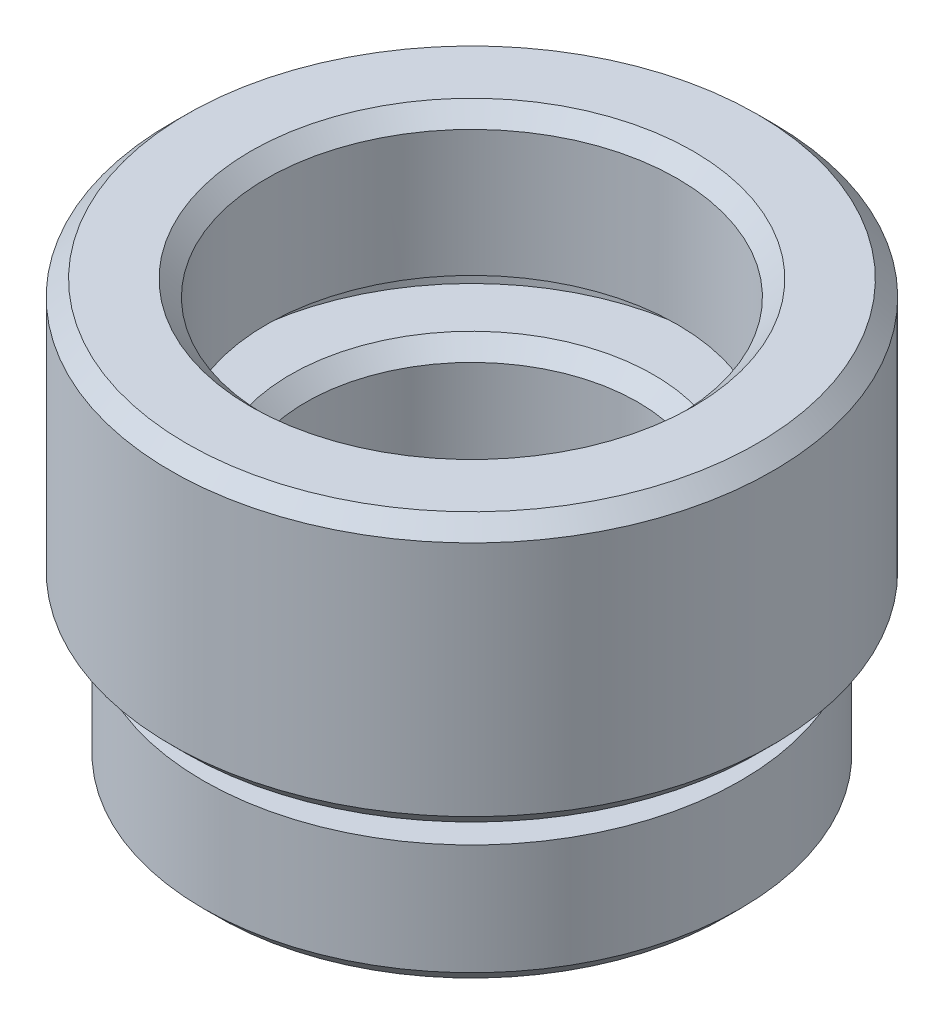
ISO-10303-21;
HEADER;
FILE_DESCRIPTION(('STEP AP214'),'2;1');
FILE_NAME('part.step','',(''),(''),'','','');
FILE_SCHEMA(('AUTOMOTIVE_DESIGN { 1 0 10303 214 1 1 1 1 }'));
ENDSEC;
DATA;
#1=APPLICATION_CONTEXT('core data for automotive mechanical design processes');
#2=APPLICATION_PROTOCOL_DEFINITION('international standard','automotive_design',2000,#1);
#3=PRODUCT_CONTEXT('',#1,'mechanical');
#4=PRODUCT('Part','Part','',(#3));
#5=PRODUCT_RELATED_PRODUCT_CATEGORY('part','',(#4));
#6=PRODUCT_DEFINITION_FORMATION('','',#4);
#7=PRODUCT_DEFINITION_CONTEXT('part definition',#1,'design');
#8=PRODUCT_DEFINITION('design','',#6,#7);
#9=PRODUCT_DEFINITION_SHAPE('','',#8);
#10=(LENGTH_UNIT() NAMED_UNIT(*) SI_UNIT(.MILLI.,.METRE.));
#11=(NAMED_UNIT(*) PLANE_ANGLE_UNIT() SI_UNIT($,.RADIAN.));
#12=(NAMED_UNIT(*) SI_UNIT($,.STERADIAN.) SOLID_ANGLE_UNIT());
#13=UNCERTAINTY_MEASURE_WITH_UNIT(LENGTH_MEASURE(1.E-05),#10,'distance_accuracy_value','');
#14=(GEOMETRIC_REPRESENTATION_CONTEXT(3) GLOBAL_UNCERTAINTY_ASSIGNED_CONTEXT((#13)) GLOBAL_UNIT_ASSIGNED_CONTEXT((#10,
#11,#12)) REPRESENTATION_CONTEXT('',''));
#15=CARTESIAN_POINT('',(0.,0.,0.));
#16=DIRECTION('',(0.,0.,1.));
#17=DIRECTION('',(1.,0.,0.));
#18=AXIS2_PLACEMENT_3D('',#15,#16,#17);
#19=CARTESIAN_POINT('',(6.5,13.5,0.));
#20=DIRECTION('',(0.,1.,0.));
#21=DIRECTION('',(0.,0.,1.));
#22=AXIS2_PLACEMENT_3D('',#19,#20,#21);
#23=PLANE('',#22);
#24=CARTESIAN_POINT('',(0.,13.5,0.));
#25=DIRECTION('',(0.,1.,0.));
#26=DIRECTION('',(0.,0.,1.));
#27=AXIS2_PLACEMENT_3D('',#24,#25,#26);
#28=CIRCLE('',#27,7.);
#29=CARTESIAN_POINT('',(0.,13.5,7.));
#30=VERTEX_POINT('',#29);
#31=EDGE_CURVE('E40',#30,#30,#28,.F.);
#32=ORIENTED_EDGE('',*,*,#31,.T.);
#33=EDGE_LOOP('',(#32));
#34=FACE_BOUND('',#33,.T.);
#35=CARTESIAN_POINT('',(0.,13.5,0.));
#36=DIRECTION('',(0.,-1.,0.));
#37=DIRECTION('',(0.,0.,-1.));
#38=AXIS2_PLACEMENT_3D('',#35,#36,#37);
#39=CIRCLE('',#38,9.025);
#40=CARTESIAN_POINT('',(0.,13.5,-9.025));
#41=VERTEX_POINT('',#40);
#42=EDGE_CURVE('E107',#41,#41,#39,.T.);
#43=ORIENTED_EDGE('',*,*,#42,.F.);
#44=EDGE_LOOP('',(#43));
#45=FACE_BOUND('',#44,.T.);
#46=ADVANCED_FACE('F33',(#34,#45),#23,.T.);
#47=CARTESIAN_POINT('',(0.,0.,0.));
#48=DIRECTION('',(0.,-1.,0.));
#49=DIRECTION('',(0.,0.,-1.));
#50=AXIS2_PLACEMENT_3D('',#47,#48,#49);
#51=CYLINDRICAL_SURFACE('',#50,6.5);
#52=CARTESIAN_POINT('',(0.,13.,0.));
#53=DIRECTION('',(0.,1.,0.));
#54=DIRECTION('',(0.,0.,1.));
#55=AXIS2_PLACEMENT_3D('',#52,#53,#54);
#56=CIRCLE('',#55,6.5);
#57=CARTESIAN_POINT('',(0.,13.,6.5));
#58=VERTEX_POINT('',#57);
#59=EDGE_CURVE('E10',#58,#58,#56,.T.);
#60=ORIENTED_EDGE('',*,*,#59,.T.);
#61=EDGE_LOOP('',(#60));
#62=FACE_BOUND('',#61,.T.);
#63=CARTESIAN_POINT('',(0.,9.,0.));
#64=DIRECTION('',(0.,-1.,0.));
#65=DIRECTION('',(0.,0.,-1.));
#66=AXIS2_PLACEMENT_3D('',#63,#64,#65);
#67=CIRCLE('',#66,6.5);
#68=CARTESIAN_POINT('',(0.,9.,-6.5));
#69=VERTEX_POINT('',#68);
#70=EDGE_CURVE('E53',#69,#69,#67,.T.);
#71=ORIENTED_EDGE('',*,*,#70,.T.);
#72=EDGE_LOOP('',(#71));
#73=FACE_BOUND('',#72,.T.);
#74=ADVANCED_FACE('F115',(#62,#73),#51,.F.);
#75=CARTESIAN_POINT('',(7.6,9.,0.));
#76=DIRECTION('',(0.,-1.,0.));
#77=DIRECTION('',(0.,0.,-1.));
#78=AXIS2_PLACEMENT_3D('',#75,#76,#77);
#79=PLANE('',#78);
#80=CARTESIAN_POINT('',(0.,9.,0.));
#81=DIRECTION('',(0.,-1.,0.));
#82=DIRECTION('',(0.,0.,-1.));
#83=AXIS2_PLACEMENT_3D('',#80,#81,#82);
#84=CIRCLE('',#83,7.6);
#85=CARTESIAN_POINT('',(0.,9.,-7.6));
#86=VERTEX_POINT('',#85);
#87=EDGE_CURVE('E56',#86,#86,#84,.T.);
#88=ORIENTED_EDGE('',*,*,#87,.T.);
#89=EDGE_LOOP('',(#88));
#90=FACE_BOUND('',#89,.T.);
#91=ORIENTED_EDGE('',*,*,#70,.F.);
#92=EDGE_LOOP('',(#91));
#93=FACE_BOUND('',#92,.T.);
#94=ADVANCED_FACE('F120',(#90,#93),#79,.T.);
#95=CARTESIAN_POINT('',(0.,0.,0.));
#96=DIRECTION('',(0.,-1.,0.));
#97=DIRECTION('',(0.,0.,-1.));
#98=AXIS2_PLACEMENT_3D('',#95,#96,#97);
#99=CYLINDRICAL_SURFACE('',#98,7.6);
#100=CARTESIAN_POINT('',(0.,8.,0.));
#101=DIRECTION('',(0.,-1.,0.));
#102=DIRECTION('',(0.,0.,-1.));
#103=AXIS2_PLACEMENT_3D('',#100,#101,#102);
#104=CIRCLE('',#103,7.6);
#105=CARTESIAN_POINT('',(0.,8.,-7.6));
#106=VERTEX_POINT('',#105);
#107=EDGE_CURVE('E59',#106,#106,#104,.T.);
#108=ORIENTED_EDGE('',*,*,#107,.T.);
#109=EDGE_LOOP('',(#108));
#110=FACE_BOUND('',#109,.T.);
#111=ORIENTED_EDGE('',*,*,#87,.F.);
#112=EDGE_LOOP('',(#111));
#113=FACE_BOUND('',#112,.T.);
#114=ADVANCED_FACE('F141',(#110,#113),#99,.F.);
#115=CARTESIAN_POINT('',(5.25,8.,0.));
#116=DIRECTION('',(0.,1.,0.));
#117=DIRECTION('',(0.,0.,1.));
#118=AXIS2_PLACEMENT_3D('',#115,#116,#117);
#119=PLANE('',#118);
#120=CARTESIAN_POINT('',(0.,8.,0.));
#121=DIRECTION('',(0.,1.,0.));
#122=DIRECTION('',(0.,0.,1.));
#123=AXIS2_PLACEMENT_3D('',#120,#121,#122);
#124=CIRCLE('',#123,5.75);
#125=CARTESIAN_POINT('',(0.,8.,5.75));
#126=VERTEX_POINT('',#125);
#127=EDGE_CURVE('E48',#126,#126,#124,.F.);
#128=ORIENTED_EDGE('',*,*,#127,.T.);
#129=EDGE_LOOP('',(#128));
#130=FACE_BOUND('',#129,.T.);
#131=ORIENTED_EDGE('',*,*,#107,.F.);
#132=EDGE_LOOP('',(#131));
#133=FACE_BOUND('',#132,.T.);
#134=ADVANCED_FACE('F137',(#130,#133),#119,.T.);
#135=CARTESIAN_POINT('',(0.,0.,0.));
#136=DIRECTION('',(0.,-1.,0.));
#137=DIRECTION('',(0.,0.,-1.));
#138=AXIS2_PLACEMENT_3D('',#135,#136,#137);
#139=CYLINDRICAL_SURFACE('',#138,5.25);
#140=CARTESIAN_POINT('',(0.,7.5,0.));
#141=DIRECTION('',(0.,1.,0.));
#142=DIRECTION('',(0.,0.,1.));
#143=AXIS2_PLACEMENT_3D('',#140,#141,#142);
#144=CIRCLE('',#143,5.25);
#145=CARTESIAN_POINT('',(0.,7.5,5.25));
#146=VERTEX_POINT('',#145);
#147=EDGE_CURVE('E44',#146,#146,#144,.T.);
#148=ORIENTED_EDGE('',*,*,#147,.T.);
#149=EDGE_LOOP('',(#148));
#150=FACE_BOUND('',#149,.T.);
#151=CARTESIAN_POINT('',(0.,4.5,0.));
#152=DIRECTION('',(0.,-1.,0.));
#153=DIRECTION('',(0.,0.,-1.));
#154=AXIS2_PLACEMENT_3D('',#151,#152,#153);
#155=CIRCLE('',#154,5.25);
#156=CARTESIAN_POINT('',(0.,4.5,-5.25));
#157=VERTEX_POINT('',#156);
#158=EDGE_CURVE('E62',#157,#157,#155,.T.);
#159=ORIENTED_EDGE('',*,*,#158,.T.);
#160=EDGE_LOOP('',(#159));
#161=FACE_BOUND('',#160,.T.);
#162=ADVANCED_FACE('F140',(#150,#161),#139,.F.);
#163=CARTESIAN_POINT('',(6.35,4.5,0.));
#164=DIRECTION('',(0.,-1.,0.));
#165=DIRECTION('',(0.,0.,-1.));
#166=AXIS2_PLACEMENT_3D('',#163,#164,#165);
#167=PLANE('',#166);
#168=CARTESIAN_POINT('',(0.,4.5,0.));
#169=DIRECTION('',(0.,-1.,0.));
#170=DIRECTION('',(0.,0.,-1.));
#171=AXIS2_PLACEMENT_3D('',#168,#169,#170);
#172=CIRCLE('',#171,6.35);
#173=CARTESIAN_POINT('',(0.,4.5,-6.35));
#174=VERTEX_POINT('',#173);
#175=EDGE_CURVE('E65',#174,#174,#172,.T.);
#176=ORIENTED_EDGE('',*,*,#175,.T.);
#177=EDGE_LOOP('',(#176));
#178=FACE_BOUND('',#177,.T.);
#179=ORIENTED_EDGE('',*,*,#158,.F.);
#180=EDGE_LOOP('',(#179));
#181=FACE_BOUND('',#180,.T.);
#182=ADVANCED_FACE('F159',(#178,#181),#167,.T.);
#183=CARTESIAN_POINT('',(0.,0.,0.));
#184=DIRECTION('',(0.,-1.,0.));
#185=DIRECTION('',(0.,0.,-1.));
#186=AXIS2_PLACEMENT_3D('',#183,#184,#185);
#187=CYLINDRICAL_SURFACE('',#186,6.35);
#188=CARTESIAN_POINT('',(0.,3.5,0.));
#189=DIRECTION('',(0.,-1.,0.));
#190=DIRECTION('',(0.,0.,-1.));
#191=AXIS2_PLACEMENT_3D('',#188,#189,#190);
#192=CIRCLE('',#191,6.35);
#193=CARTESIAN_POINT('',(0.,3.5,-6.35));
#194=VERTEX_POINT('',#193);
#195=EDGE_CURVE('E68',#194,#194,#192,.T.);
#196=ORIENTED_EDGE('',*,*,#195,.T.);
#197=EDGE_LOOP('',(#196));
#198=FACE_BOUND('',#197,.T.);
#199=ORIENTED_EDGE('',*,*,#175,.F.);
#200=EDGE_LOOP('',(#199));
#201=FACE_BOUND('',#200,.T.);
#202=ADVANCED_FACE('F163',(#198,#201),#187,.F.);
#203=CARTESIAN_POINT('',(5.,3.5,0.));
#204=DIRECTION('',(0.,1.,0.));
#205=DIRECTION('',(0.,0.,1.));
#206=AXIS2_PLACEMENT_3D('',#203,#204,#205);
#207=PLANE('',#206);
#208=CARTESIAN_POINT('',(0.,3.5,0.));
#209=DIRECTION('',(0.,-1.,0.));
#210=DIRECTION('',(0.,0.,-1.));
#211=AXIS2_PLACEMENT_3D('',#208,#209,#210);
#212=CIRCLE('',#211,5.);
#213=CARTESIAN_POINT('',(0.,3.5,-5.));
#214=VERTEX_POINT('',#213);
#215=EDGE_CURVE('E71',#214,#214,#212,.T.);
#216=ORIENTED_EDGE('',*,*,#215,.T.);
#217=EDGE_LOOP('',(#216));
#218=FACE_BOUND('',#217,.T.);
#219=ORIENTED_EDGE('',*,*,#195,.F.);
#220=EDGE_LOOP('',(#219));
#221=FACE_BOUND('',#220,.T.);
#222=ADVANCED_FACE('F167',(#218,#221),#207,.T.);
#223=CARTESIAN_POINT('',(0.,0.,0.));
#224=DIRECTION('',(0.,-1.,0.));
#225=DIRECTION('',(0.,0.,-1.));
#226=AXIS2_PLACEMENT_3D('',#223,#224,#225);
#227=CYLINDRICAL_SURFACE('',#226,5.);
#228=CARTESIAN_POINT('',(0.,2.,0.));
#229=DIRECTION('',(0.,-1.,0.));
#230=DIRECTION('',(0.,0.,-1.));
#231=AXIS2_PLACEMENT_3D('',#228,#229,#230);
#232=CIRCLE('',#231,5.);
#233=CARTESIAN_POINT('',(0.,2.,-5.));
#234=VERTEX_POINT('',#233);
#235=EDGE_CURVE('E74',#234,#234,#232,.T.);
#236=ORIENTED_EDGE('',*,*,#235,.T.);
#237=EDGE_LOOP('',(#236));
#238=FACE_BOUND('',#237,.T.);
#239=ORIENTED_EDGE('',*,*,#215,.F.);
#240=EDGE_LOOP('',(#239));
#241=FACE_BOUND('',#240,.T.);
#242=ADVANCED_FACE('F171',(#238,#241),#227,.F.);
#243=CARTESIAN_POINT('',(4.5,2.,0.));
#244=DIRECTION('',(0.,1.,0.));
#245=DIRECTION('',(0.,0.,1.));
#246=AXIS2_PLACEMENT_3D('',#243,#244,#245);
#247=PLANE('',#246);
#248=CARTESIAN_POINT('',(0.,2.,0.));
#249=DIRECTION('',(0.,-1.,0.));
#250=DIRECTION('',(0.,0.,-1.));
#251=AXIS2_PLACEMENT_3D('',#248,#249,#250);
#252=CIRCLE('',#251,4.5);
#253=CARTESIAN_POINT('',(0.,2.,-4.5));
#254=VERTEX_POINT('',#253);
#255=EDGE_CURVE('E77',#254,#254,#252,.T.);
#256=ORIENTED_EDGE('',*,*,#255,.T.);
#257=EDGE_LOOP('',(#256));
#258=FACE_BOUND('',#257,.T.);
#259=ORIENTED_EDGE('',*,*,#235,.F.);
#260=EDGE_LOOP('',(#259));
#261=FACE_BOUND('',#260,.T.);
#262=ADVANCED_FACE('F175',(#258,#261),#247,.T.);
#263=CARTESIAN_POINT('',(0.,0.,0.));
#264=DIRECTION('',(0.,-1.,0.));
#265=DIRECTION('',(0.,0.,-1.));
#266=AXIS2_PLACEMENT_3D('',#263,#264,#265);
#267=CYLINDRICAL_SURFACE('',#266,4.5);
#268=CARTESIAN_POINT('',(0.,0.,0.));
#269=DIRECTION('',(0.,-1.,0.));
#270=DIRECTION('',(0.,0.,-1.));
#271=AXIS2_PLACEMENT_3D('',#268,#269,#270);
#272=CIRCLE('',#271,4.5);
#273=CARTESIAN_POINT('',(0.,0.,-4.5));
#274=VERTEX_POINT('',#273);
#275=EDGE_CURVE('E80',#274,#274,#272,.T.);
#276=ORIENTED_EDGE('',*,*,#275,.T.);
#277=EDGE_LOOP('',(#276));
#278=FACE_BOUND('',#277,.T.);
#279=ORIENTED_EDGE('',*,*,#255,.F.);
#280=EDGE_LOOP('',(#279));
#281=FACE_BOUND('',#280,.T.);
#282=ADVANCED_FACE('F179',(#278,#281),#267,.F.);
#283=CARTESIAN_POINT('',(4.5,0.,0.));
#284=DIRECTION('',(0.,-1.,0.));
#285=DIRECTION('',(0.,0.,-1.));
#286=AXIS2_PLACEMENT_3D('',#283,#284,#285);
#287=PLANE('',#286);
#288=CARTESIAN_POINT('',(0.,0.,0.));
#289=DIRECTION('',(0.,-1.,0.));
#290=DIRECTION('',(0.,0.,-1.));
#291=AXIS2_PLACEMENT_3D('',#288,#289,#290);
#292=CIRCLE('',#291,8.);
#293=CARTESIAN_POINT('',(0.,0.,-8.));
#294=VERTEX_POINT('',#293);
#295=EDGE_CURVE('E83',#294,#294,#292,.T.);
#296=ORIENTED_EDGE('',*,*,#295,.T.);
#297=EDGE_LOOP('',(#296));
#298=FACE_BOUND('',#297,.T.);
#299=ORIENTED_EDGE('',*,*,#275,.F.);
#300=EDGE_LOOP('',(#299));
#301=FACE_BOUND('',#300,.T.);
#302=ADVANCED_FACE('F183',(#298,#301),#287,.T.);
#303=CARTESIAN_POINT('',(0.,0.,0.));
#304=DIRECTION('',(0.,1.,0.));
#305=DIRECTION('',(0.,0.,1.));
#306=AXIS2_PLACEMENT_3D('',#303,#304,#305);
#307=CONICAL_SURFACE('',#306,8.,0.785398163397451);
#308=CARTESIAN_POINT('',(0.,0.499999999999998,0.));
#309=DIRECTION('',(0.,-1.,0.));
#310=DIRECTION('',(0.,0.,-1.));
#311=AXIS2_PLACEMENT_3D('',#308,#309,#310);
#312=CIRCLE('',#311,8.5);
#313=CARTESIAN_POINT('',(0.,0.499999999999998,-8.5));
#314=VERTEX_POINT('',#313);
#315=EDGE_CURVE('E86',#314,#314,#312,.T.);
#316=ORIENTED_EDGE('',*,*,#315,.T.);
#317=EDGE_LOOP('',(#316));
#318=FACE_BOUND('',#317,.T.);
#319=ORIENTED_EDGE('',*,*,#295,.F.);
#320=EDGE_LOOP('',(#319));
#321=FACE_BOUND('',#320,.T.);
#322=ADVANCED_FACE('F187',(#318,#321),#307,.T.);
#323=CARTESIAN_POINT('',(0.,0.,0.));
#324=DIRECTION('',(0.,-1.,0.));
#325=DIRECTION('',(0.,0.,-1.));
#326=AXIS2_PLACEMENT_3D('',#323,#324,#325);
#327=CYLINDRICAL_SURFACE('',#326,8.5);
#328=CARTESIAN_POINT('',(0.,4.,0.));
#329=DIRECTION('',(0.,-1.,0.));
#330=DIRECTION('',(0.,0.,-1.));
#331=AXIS2_PLACEMENT_3D('',#328,#329,#330);
#332=CIRCLE('',#331,8.5);
#333=CARTESIAN_POINT('',(0.,4.,-8.5));
#334=VERTEX_POINT('',#333);
#335=EDGE_CURVE('E89',#334,#334,#332,.T.);
#336=ORIENTED_EDGE('',*,*,#335,.T.);
#337=EDGE_LOOP('',(#336));
#338=FACE_BOUND('',#337,.T.);
#339=ORIENTED_EDGE('',*,*,#315,.F.);
#340=EDGE_LOOP('',(#339));
#341=FACE_BOUND('',#340,.T.);
#342=ADVANCED_FACE('F191',(#338,#341),#327,.T.);
#343=CARTESIAN_POINT('',(8.5,4.,0.));
#344=DIRECTION('',(0.,1.,0.));
#345=DIRECTION('',(0.,0.,1.));
#346=AXIS2_PLACEMENT_3D('',#343,#344,#345);
#347=PLANE('',#346);
#348=CARTESIAN_POINT('',(0.,4.,0.));
#349=DIRECTION('',(0.,-1.,0.));
#350=DIRECTION('',(0.,0.,-1.));
#351=AXIS2_PLACEMENT_3D('',#348,#349,#350);
#352=CIRCLE('',#351,7.);
#353=CARTESIAN_POINT('',(0.,4.,-7.));
#354=VERTEX_POINT('',#353);
#355=EDGE_CURVE('E92',#354,#354,#352,.T.);
#356=ORIENTED_EDGE('',*,*,#355,.T.);
#357=EDGE_LOOP('',(#356));
#358=FACE_BOUND('',#357,.T.);
#359=ORIENTED_EDGE('',*,*,#335,.F.);
#360=EDGE_LOOP('',(#359));
#361=FACE_BOUND('',#360,.T.);
#362=ADVANCED_FACE('F195',(#358,#361),#347,.T.);
#363=CARTESIAN_POINT('',(0.,0.,0.));
#364=DIRECTION('',(0.,-1.,0.));
#365=DIRECTION('',(0.,0.,-1.));
#366=AXIS2_PLACEMENT_3D('',#363,#364,#365);
#367=CYLINDRICAL_SURFACE('',#366,7.);
#368=CARTESIAN_POINT('',(0.,5.,0.));
#369=DIRECTION('',(0.,-1.,0.));
#370=DIRECTION('',(0.,0.,-1.));
#371=AXIS2_PLACEMENT_3D('',#368,#369,#370);
#372=CIRCLE('',#371,7.);
#373=CARTESIAN_POINT('',(0.,5.,-7.));
#374=VERTEX_POINT('',#373);
#375=EDGE_CURVE('E95',#374,#374,#372,.T.);
#376=ORIENTED_EDGE('',*,*,#375,.T.);
#377=EDGE_LOOP('',(#376));
#378=FACE_BOUND('',#377,.T.);
#379=ORIENTED_EDGE('',*,*,#355,.F.);
#380=EDGE_LOOP('',(#379));
#381=FACE_BOUND('',#380,.T.);
#382=ADVANCED_FACE('F199',(#378,#381),#367,.T.);
#383=CARTESIAN_POINT('',(7.,5.,0.));
#384=DIRECTION('',(0.,-1.,0.));
#385=DIRECTION('',(0.,0.,-1.));
#386=AXIS2_PLACEMENT_3D('',#383,#384,#385);
#387=PLANE('',#386);
#388=CARTESIAN_POINT('',(0.,5.,0.));
#389=DIRECTION('',(0.,-1.,0.));
#390=DIRECTION('',(0.,0.,-1.));
#391=AXIS2_PLACEMENT_3D('',#388,#389,#390);
#392=CIRCLE('',#391,9.025);
#393=CARTESIAN_POINT('',(0.,5.,-9.025));
#394=VERTEX_POINT('',#393);
#395=EDGE_CURVE('E98',#394,#394,#392,.T.);
#396=ORIENTED_EDGE('',*,*,#395,.T.);
#397=EDGE_LOOP('',(#396));
#398=FACE_BOUND('',#397,.T.);
#399=ORIENTED_EDGE('',*,*,#375,.F.);
#400=EDGE_LOOP('',(#399));
#401=FACE_BOUND('',#400,.T.);
#402=ADVANCED_FACE('F203',(#398,#401),#387,.T.);
#403=CARTESIAN_POINT('',(0.,5.,0.));
#404=DIRECTION('',(0.,1.,0.));
#405=DIRECTION('',(0.,0.,1.));
#406=AXIS2_PLACEMENT_3D('',#403,#404,#405);
#407=CONICAL_SURFACE('',#406,9.025,0.785398163397451);
#408=CARTESIAN_POINT('',(0.,5.5,0.));
#409=DIRECTION('',(0.,-1.,0.));
#410=DIRECTION('',(0.,0.,-1.));
#411=AXIS2_PLACEMENT_3D('',#408,#409,#410);
#412=CIRCLE('',#411,9.525);
#413=CARTESIAN_POINT('',(0.,5.5,-9.525));
#414=VERTEX_POINT('',#413);
#415=EDGE_CURVE('E101',#414,#414,#412,.T.);
#416=ORIENTED_EDGE('',*,*,#415,.T.);
#417=EDGE_LOOP('',(#416));
#418=FACE_BOUND('',#417,.T.);
#419=ORIENTED_EDGE('',*,*,#395,.F.);
#420=EDGE_LOOP('',(#419));
#421=FACE_BOUND('',#420,.T.);
#422=ADVANCED_FACE('F207',(#418,#421),#407,.T.);
#423=CARTESIAN_POINT('',(0.,0.,0.));
#424=DIRECTION('',(0.,-1.,0.));
#425=DIRECTION('',(0.,0.,-1.));
#426=AXIS2_PLACEMENT_3D('',#423,#424,#425);
#427=CYLINDRICAL_SURFACE('',#426,9.525);
#428=CARTESIAN_POINT('',(0.,13.,0.));
#429=DIRECTION('',(0.,-1.,0.));
#430=DIRECTION('',(0.,0.,-1.));
#431=AXIS2_PLACEMENT_3D('',#428,#429,#430);
#432=CIRCLE('',#431,9.525);
#433=CARTESIAN_POINT('',(0.,13.,-9.525));
#434=VERTEX_POINT('',#433);
#435=EDGE_CURVE('E104',#434,#434,#432,.T.);
#436=ORIENTED_EDGE('',*,*,#435,.T.);
#437=EDGE_LOOP('',(#436));
#438=FACE_BOUND('',#437,.T.);
#439=ORIENTED_EDGE('',*,*,#415,.F.);
#440=EDGE_LOOP('',(#439));
#441=FACE_BOUND('',#440,.T.);
#442=ADVANCED_FACE('F131',(#438,#441),#427,.T.);
#443=CARTESIAN_POINT('',(0.,13.,0.));
#444=DIRECTION('',(0.,-1.,0.));
#445=DIRECTION('',(0.,0.,-1.));
#446=AXIS2_PLACEMENT_3D('',#443,#444,#445);
#447=CONICAL_SURFACE('',#446,9.525,0.785398163397445);
#448=ORIENTED_EDGE('',*,*,#42,.T.);
#449=EDGE_LOOP('',(#448));
#450=FACE_BOUND('',#449,.T.);
#451=ORIENTED_EDGE('',*,*,#435,.F.);
#452=EDGE_LOOP('',(#451));
#453=FACE_BOUND('',#452,.T.);
#454=ADVANCED_FACE('F111',(#450,#453),#447,.T.);
#455=CARTESIAN_POINT('',(0.,8.,0.));
#456=DIRECTION('',(0.,1.,0.));
#457=DIRECTION('',(0.,0.,1.));
#458=AXIS2_PLACEMENT_3D('',#455,#456,#457);
#459=CONICAL_SURFACE('',#458,5.75,0.785398163397446);
#460=ORIENTED_EDGE('',*,*,#147,.F.);
#461=EDGE_LOOP('',(#460));
#462=FACE_BOUND('',#461,.T.);
#463=ORIENTED_EDGE('',*,*,#127,.F.);
#464=EDGE_LOOP('',(#463));
#465=FACE_BOUND('',#464,.T.);
#466=ADVANCED_FACE('F123',(#462,#465),#459,.F.);
#467=CARTESIAN_POINT('',(0.,13.5,0.));
#468=DIRECTION('',(0.,1.,0.));
#469=DIRECTION('',(0.,0.,1.));
#470=AXIS2_PLACEMENT_3D('',#467,#468,#469);
#471=CONICAL_SURFACE('',#470,7.,0.785398163397444);
#472=ORIENTED_EDGE('',*,*,#59,.F.);
#473=EDGE_LOOP('',(#472));
#474=FACE_BOUND('',#473,.T.);
#475=ORIENTED_EDGE('',*,*,#31,.F.);
#476=EDGE_LOOP('',(#475));
#477=FACE_BOUND('',#476,.T.);
#478=ADVANCED_FACE('F35',(#474,#477),#471,.F.);
#479=CLOSED_SHELL('',(#46,#74,#94,#114,#134,#162,#182,#202,#222,#242,#262,#282,#302,#322,#342,
#362,#382,#402,#422,#442,#454,#466,#478));
#480=MANIFOLD_SOLID_BREP('B2',#479);
#481=ADVANCED_BREP_SHAPE_REPRESENTATION('',(#18,#480),#14);
#482=SHAPE_DEFINITION_REPRESENTATION(#9,#481);
ENDSEC;
END-ISO-10303-21;
